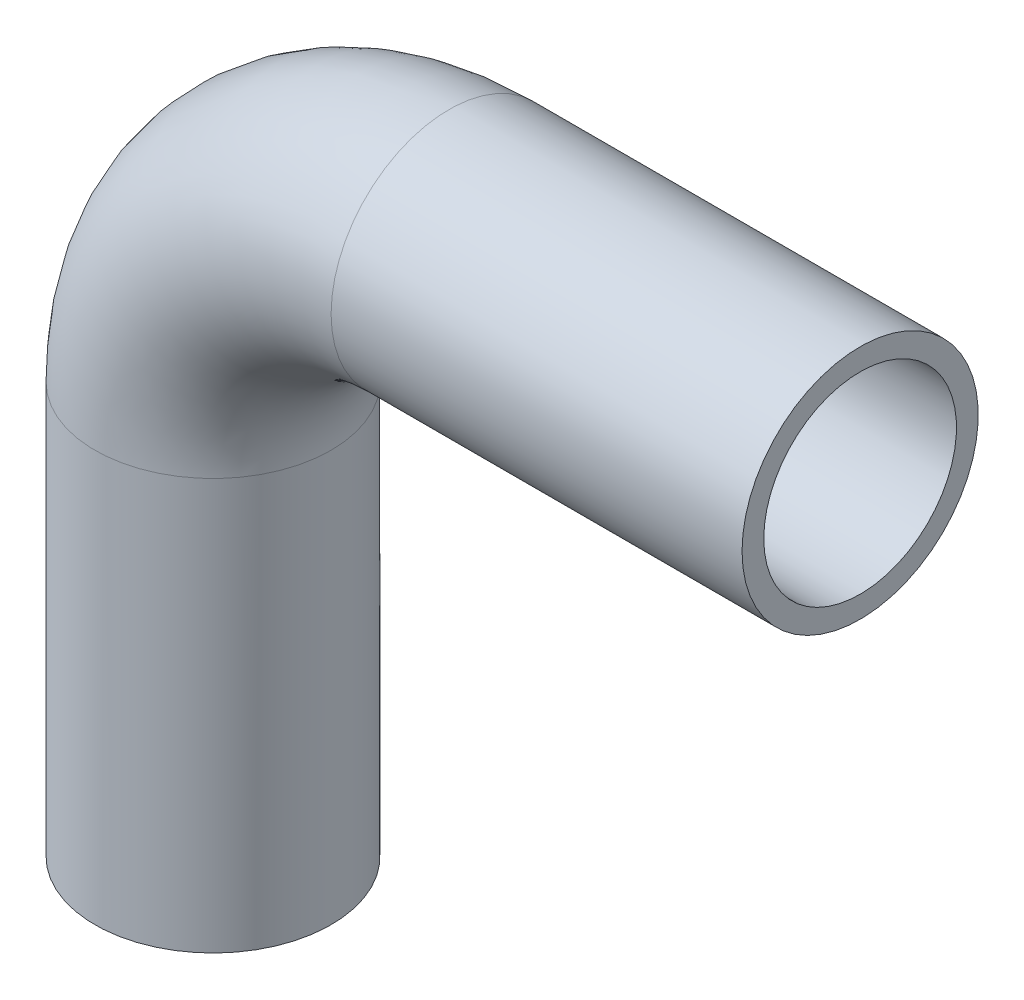
ISO-10303-21;
HEADER;
FILE_DESCRIPTION(('STEP AP214'),'2;1');
FILE_NAME('part.step','',(''),(''),'','','');
FILE_SCHEMA(('AUTOMOTIVE_DESIGN { 1 0 10303 214 1 1 1 1 }'));
ENDSEC;
DATA;
#1=APPLICATION_CONTEXT('core data for automotive mechanical design processes');
#2=APPLICATION_PROTOCOL_DEFINITION('international standard','automotive_design',2000,#1);
#3=PRODUCT_CONTEXT('',#1,'mechanical');
#4=PRODUCT('Part','Part','',(#3));
#5=PRODUCT_RELATED_PRODUCT_CATEGORY('part','',(#4));
#6=PRODUCT_DEFINITION_FORMATION('','',#4);
#7=PRODUCT_DEFINITION_CONTEXT('part definition',#1,'design');
#8=PRODUCT_DEFINITION('design','',#6,#7);
#9=PRODUCT_DEFINITION_SHAPE('','',#8);
#10=(LENGTH_UNIT() NAMED_UNIT(*) SI_UNIT(.MILLI.,.METRE.));
#11=(NAMED_UNIT(*) PLANE_ANGLE_UNIT() SI_UNIT($,.RADIAN.));
#12=(NAMED_UNIT(*) SI_UNIT($,.STERADIAN.) SOLID_ANGLE_UNIT());
#13=UNCERTAINTY_MEASURE_WITH_UNIT(LENGTH_MEASURE(1.E-05),#10,'distance_accuracy_value','');
#14=(GEOMETRIC_REPRESENTATION_CONTEXT(3) GLOBAL_UNCERTAINTY_ASSIGNED_CONTEXT((#13)) GLOBAL_UNIT_ASSIGNED_CONTEXT((#10,
#11,#12)) REPRESENTATION_CONTEXT('',''));
#15=CARTESIAN_POINT('',(0.,0.,0.));
#16=DIRECTION('',(0.,0.,1.));
#17=DIRECTION('',(1.,0.,0.));
#18=AXIS2_PLACEMENT_3D('',#15,#16,#17);
#19=CARTESIAN_POINT('',(25.,43.5,0.));
#20=DIRECTION('',(0.,0.,1.));
#21=DIRECTION('',(1.,0.,0.));
#22=AXIS2_PLACEMENT_3D('',#19,#20,#21);
#23=TOROIDAL_SURFACE('',#22,25.,10.2);
#24=CARTESIAN_POINT('',(25.,68.5,0.));
#25=DIRECTION('',(-1.,0.,0.));
#26=DIRECTION('',(0.,1.,0.));
#27=AXIS2_PLACEMENT_3D('',#24,#25,#26);
#28=CIRCLE('',#27,10.2);
#29=CARTESIAN_POINT('',(25.,78.7,0.));
#30=VERTEX_POINT('',#29);
#31=EDGE_CURVE('E33',#30,#30,#28,.T.);
#32=ORIENTED_EDGE('',*,*,#31,.F.);
#33=EDGE_LOOP('',(#32));
#34=FACE_BOUND('',#33,.T.);
#35=CARTESIAN_POINT('',(0.,43.5,0.));
#36=DIRECTION('',(0.,-1.,0.));
#37=DIRECTION('',(-1.,0.,0.));
#38=AXIS2_PLACEMENT_3D('',#35,#36,#37);
#39=CIRCLE('',#38,10.2);
#40=CARTESIAN_POINT('',(-10.2,43.5,0.));
#41=VERTEX_POINT('',#40);
#42=EDGE_CURVE('E31',#41,#41,#39,.F.);
#43=ORIENTED_EDGE('',*,*,#42,.F.);
#44=EDGE_LOOP('',(#43));
#45=FACE_BOUND('',#44,.T.);
#46=ADVANCED_FACE('F13',(#34,#45),#23,.F.);
#47=CARTESIAN_POINT('',(68.5,68.5,0.));
#48=DIRECTION('',(-1.,0.,0.));
#49=DIRECTION('',(0.,0.,1.));
#50=AXIS2_PLACEMENT_3D('',#47,#48,#49);
#51=CYLINDRICAL_SURFACE('',#50,10.2);
#52=CARTESIAN_POINT('',(68.5,68.5,0.));
#53=DIRECTION('',(-1.,0.,0.));
#54=DIRECTION('',(0.,0.,1.));
#55=AXIS2_PLACEMENT_3D('',#52,#53,#54);
#56=CIRCLE('',#55,10.2);
#57=CARTESIAN_POINT('',(68.5,68.5,10.2));
#58=VERTEX_POINT('',#57);
#59=EDGE_CURVE('E17',#58,#58,#56,.T.);
#60=ORIENTED_EDGE('',*,*,#59,.F.);
#61=EDGE_LOOP('',(#60));
#62=FACE_BOUND('',#61,.T.);
#63=ORIENTED_EDGE('',*,*,#31,.T.);
#64=EDGE_LOOP('',(#63));
#65=FACE_BOUND('',#64,.T.);
#66=ADVANCED_FACE('F52',(#62,#65),#51,.F.);
#67=CARTESIAN_POINT('',(0.,43.5,0.));
#68=DIRECTION('',(0.,-1.,0.));
#69=DIRECTION('',(0.,0.,-1.));
#70=AXIS2_PLACEMENT_3D('',#67,#68,#69);
#71=CYLINDRICAL_SURFACE('',#70,10.2);
#72=ORIENTED_EDGE('',*,*,#42,.T.);
#73=EDGE_LOOP('',(#72));
#74=FACE_BOUND('',#73,.T.);
#75=CARTESIAN_POINT('',(0.,0.,0.));
#76=DIRECTION('',(0.,-1.,0.));
#77=DIRECTION('',(0.,0.,-1.));
#78=AXIS2_PLACEMENT_3D('',#75,#76,#77);
#79=CIRCLE('',#78,10.2);
#80=CARTESIAN_POINT('',(0.,0.,-10.2));
#81=VERTEX_POINT('',#80);
#82=EDGE_CURVE('E42',#81,#81,#79,.F.);
#83=ORIENTED_EDGE('',*,*,#82,.F.);
#84=EDGE_LOOP('',(#83));
#85=FACE_BOUND('',#84,.T.);
#86=ADVANCED_FACE('F55',(#74,#85),#71,.F.);
#87=CARTESIAN_POINT('',(68.5,81.,12.6500021082908));
#88=DIRECTION('',(1.,0.,0.));
#89=DIRECTION('',(0.,-1.,0.));
#90=AXIS2_PLACEMENT_3D('',#87,#88,#89);
#91=PLANE('',#90);
#92=ORIENTED_EDGE('',*,*,#59,.T.);
#93=EDGE_LOOP('',(#92));
#94=FACE_BOUND('',#93,.T.);
#95=CARTESIAN_POINT('',(68.5,68.5,0.));
#96=DIRECTION('',(-1.,0.,0.));
#97=DIRECTION('',(0.,0.,1.));
#98=AXIS2_PLACEMENT_3D('',#95,#96,#97);
#99=CIRCLE('',#98,12.5);
#100=CARTESIAN_POINT('',(68.5,68.5,12.5));
#101=VERTEX_POINT('',#100);
#102=EDGE_CURVE('E40',#101,#101,#99,.T.);
#103=ORIENTED_EDGE('',*,*,#102,.F.);
#104=EDGE_LOOP('',(#103));
#105=FACE_BOUND('',#104,.T.);
#106=ADVANCED_FACE('F49',(#94,#105),#91,.T.);
#107=CARTESIAN_POINT('',(12.5,0.,12.6500021083317));
#108=DIRECTION('',(0.,-1.,0.));
#109=DIRECTION('',(-1.,0.,0.));
#110=AXIS2_PLACEMENT_3D('',#107,#108,#109);
#111=PLANE('',#110);
#112=ORIENTED_EDGE('',*,*,#82,.T.);
#113=EDGE_LOOP('',(#112));
#114=FACE_BOUND('',#113,.T.);
#115=CARTESIAN_POINT('',(0.,0.,0.));
#116=DIRECTION('',(0.,-1.,0.));
#117=DIRECTION('',(0.,0.,-1.));
#118=AXIS2_PLACEMENT_3D('',#115,#116,#117);
#119=CIRCLE('',#118,12.5);
#120=CARTESIAN_POINT('',(0.,0.,-12.5));
#121=VERTEX_POINT('',#120);
#122=EDGE_CURVE('E26',#121,#121,#119,.F.);
#123=ORIENTED_EDGE('',*,*,#122,.F.);
#124=EDGE_LOOP('',(#123));
#125=FACE_BOUND('',#124,.T.);
#126=ADVANCED_FACE('F69',(#114,#125),#111,.T.);
#127=CARTESIAN_POINT('',(25.,68.5,0.));
#128=DIRECTION('',(-1.,0.,0.));
#129=DIRECTION('',(0.,0.,1.));
#130=AXIS2_PLACEMENT_3D('',#127,#128,#129);
#131=CYLINDRICAL_SURFACE('',#130,12.5);
#132=ORIENTED_EDGE('',*,*,#102,.T.);
#133=EDGE_LOOP('',(#132));
#134=FACE_BOUND('',#133,.T.);
#135=CARTESIAN_POINT('',(25.,68.5,0.));
#136=DIRECTION('',(-1.,0.,0.));
#137=DIRECTION('',(0.,-1.,0.));
#138=AXIS2_PLACEMENT_3D('',#135,#136,#137);
#139=CIRCLE('',#138,12.5);
#140=CARTESIAN_POINT('',(25.,56.,0.));
#141=VERTEX_POINT('',#140);
#142=EDGE_CURVE('E21',#141,#141,#139,.T.);
#143=ORIENTED_EDGE('',*,*,#142,.F.);
#144=EDGE_LOOP('',(#143));
#145=FACE_BOUND('',#144,.T.);
#146=ADVANCED_FACE('F79',(#134,#145),#131,.T.);
#147=CARTESIAN_POINT('',(0.,0.,0.));
#148=DIRECTION('',(0.,-1.,0.));
#149=DIRECTION('',(0.,0.,-1.));
#150=AXIS2_PLACEMENT_3D('',#147,#148,#149);
#151=CYLINDRICAL_SURFACE('',#150,12.5);
#152=CARTESIAN_POINT('',(0.,43.5,0.));
#153=DIRECTION('',(0.,-1.,0.));
#154=DIRECTION('',(1.,0.,0.));
#155=AXIS2_PLACEMENT_3D('',#152,#153,#154);
#156=CIRCLE('',#155,12.5);
#157=CARTESIAN_POINT('',(12.5,43.5,0.));
#158=VERTEX_POINT('',#157);
#159=EDGE_CURVE('E8',#158,#158,#156,.F.);
#160=ORIENTED_EDGE('',*,*,#159,.F.);
#161=EDGE_LOOP('',(#160));
#162=FACE_BOUND('',#161,.T.);
#163=ORIENTED_EDGE('',*,*,#122,.T.);
#164=EDGE_LOOP('',(#163));
#165=FACE_BOUND('',#164,.T.);
#166=ADVANCED_FACE('F73',(#162,#165),#151,.T.);
#167=CARTESIAN_POINT('',(25.,43.5,0.));
#168=DIRECTION('',(0.,0.,1.));
#169=DIRECTION('',(1.,0.,0.));
#170=AXIS2_PLACEMENT_3D('',#167,#168,#169);
#171=TOROIDAL_SURFACE('',#170,25.,12.5);
#172=ORIENTED_EDGE('',*,*,#142,.T.);
#173=EDGE_LOOP('',(#172));
#174=FACE_BOUND('',#173,.T.);
#175=ORIENTED_EDGE('',*,*,#159,.T.);
#176=EDGE_LOOP('',(#175));
#177=FACE_BOUND('',#176,.T.);
#178=ADVANCED_FACE('F71',(#174,#177),#171,.T.);
#179=CLOSED_SHELL('',(#46,#66,#86,#106,#126,#146,#166,#178));
#180=MANIFOLD_SOLID_BREP('B1',#179);
#181=ADVANCED_BREP_SHAPE_REPRESENTATION('',(#18,#180),#14);
#182=SHAPE_DEFINITION_REPRESENTATION(#9,#181);
ENDSEC;
END-ISO-10303-21;
